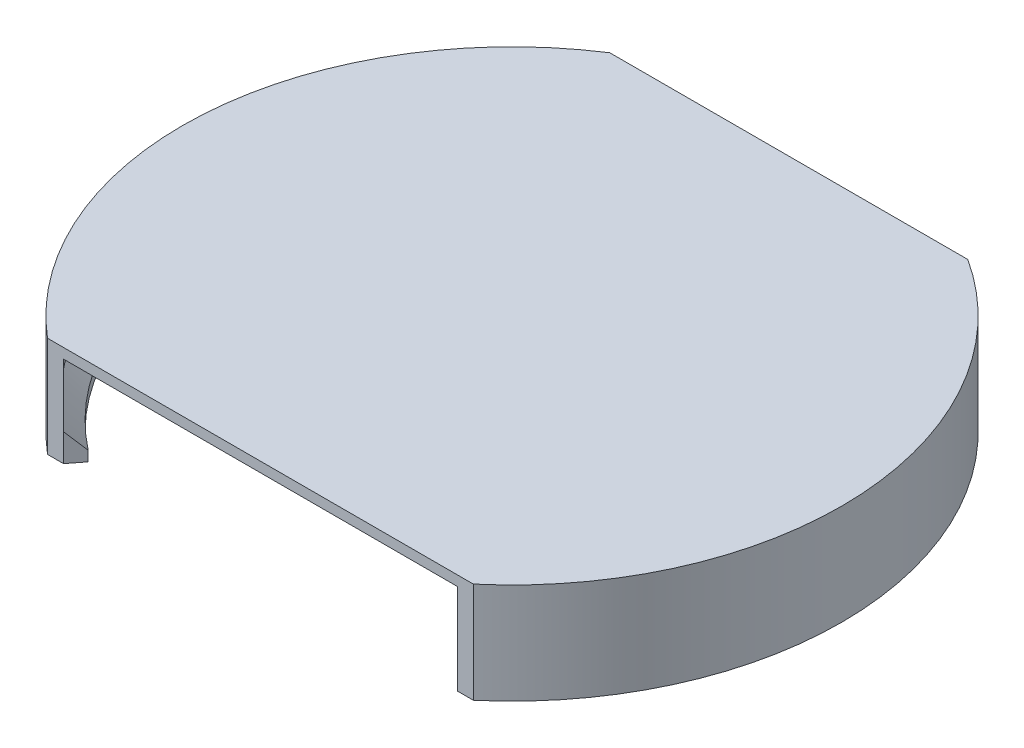
ISO-10303-21;
HEADER;
FILE_DESCRIPTION(('STEP AP214'),'2;1');
FILE_NAME('part.step','',(''),(''),'','','');
FILE_SCHEMA(('AUTOMOTIVE_DESIGN { 1 0 10303 214 1 1 1 1 }'));
ENDSEC;
DATA;
#1=APPLICATION_CONTEXT('core data for automotive mechanical design processes');
#2=APPLICATION_PROTOCOL_DEFINITION('international standard','automotive_design',2000,#1);
#3=PRODUCT_CONTEXT('',#1,'mechanical');
#4=PRODUCT('Part','Part','',(#3));
#5=PRODUCT_RELATED_PRODUCT_CATEGORY('part','',(#4));
#6=PRODUCT_DEFINITION_FORMATION('','',#4);
#7=PRODUCT_DEFINITION_CONTEXT('part definition',#1,'design');
#8=PRODUCT_DEFINITION('design','',#6,#7);
#9=PRODUCT_DEFINITION_SHAPE('','',#8);
#10=(LENGTH_UNIT() NAMED_UNIT(*) SI_UNIT(.MILLI.,.METRE.));
#11=(NAMED_UNIT(*) PLANE_ANGLE_UNIT() SI_UNIT($,.RADIAN.));
#12=(NAMED_UNIT(*) SI_UNIT($,.STERADIAN.) SOLID_ANGLE_UNIT());
#13=UNCERTAINTY_MEASURE_WITH_UNIT(LENGTH_MEASURE(1.E-05),#10,'distance_accuracy_value','');
#14=(GEOMETRIC_REPRESENTATION_CONTEXT(3) GLOBAL_UNCERTAINTY_ASSIGNED_CONTEXT((#13)) GLOBAL_UNIT_ASSIGNED_CONTEXT((#10,
#11,#12)) REPRESENTATION_CONTEXT('',''));
#15=CARTESIAN_POINT('',(0.,0.,0.));
#16=DIRECTION('',(0.,0.,1.));
#17=DIRECTION('',(1.,0.,0.));
#18=AXIS2_PLACEMENT_3D('',#15,#16,#17);
#19=CARTESIAN_POINT('',(31.7372021451167,2.,-55.));
#20=DIRECTION('',(0.,0.,1.));
#21=DIRECTION('',(1.,0.,0.));
#22=AXIS2_PLACEMENT_3D('',#19,#20,#21);
#23=PLANE('',#22);
#24=DIRECTION('',(-1.,0.,0.));
#25=VECTOR('',#24,1.);
#26=CARTESIAN_POINT('',(31.7372021451167,0.,-55.));
#27=LINE('',#26,#25);
#28=CARTESIAN_POINT('',(31.7372021451167,0.,-55.));
#29=VERTEX_POINT('',#28);
#30=CARTESIAN_POINT('',(-31.7372021451167,0.,-55.));
#31=VERTEX_POINT('',#30);
#32=EDGE_CURVE('E72',#29,#31,#27,.T.);
#33=ORIENTED_EDGE('',*,*,#32,.T.);
#34=DIRECTION('',(0.,-1.,0.));
#35=VECTOR('',#34,1.);
#36=CARTESIAN_POINT('',(-31.7372021451167,112.29472570794,-55.));
#37=LINE('',#36,#35);
#38=CARTESIAN_POINT('',(-31.7372021451167,-12.5,-55.));
#39=VERTEX_POINT('',#38);
#40=EDGE_CURVE('E176',#31,#39,#37,.T.);
#41=ORIENTED_EDGE('',*,*,#40,.T.);
#42=DIRECTION('',(0.,1.,0.));
#43=VECTOR('',#42,1.);
#44=CARTESIAN_POINT('',(-31.7372021451167,-18.,-55.));
#45=LINE('',#44,#43);
#46=CARTESIAN_POINT('',(-31.7372021451167,-18.,-55.));
#47=VERTEX_POINT('',#46);
#48=EDGE_CURVE('E154',#47,#39,#45,.T.);
#49=ORIENTED_EDGE('',*,*,#48,.F.);
#50=DIRECTION('',(1.,0.,0.));
#51=VECTOR('',#50,1.);
#52=CARTESIAN_POINT('',(0.,-18.,-55.));
#53=LINE('',#52,#51);
#54=CARTESIAN_POINT('',(-35.5703528236648,-18.,-55.));
#55=VERTEX_POINT('',#54);
#56=EDGE_CURVE('E163',#55,#47,#53,.T.);
#57=ORIENTED_EDGE('',*,*,#56,.F.);
#58=DIRECTION('',(0.,-1.,0.));
#59=VECTOR('',#58,1.);
#60=CARTESIAN_POINT('',(-35.5703528236648,112.29472570794,-55.));
#61=LINE('',#60,#59);
#62=CARTESIAN_POINT('',(-35.5703528236648,2.,-55.));
#63=VERTEX_POINT('',#62);
#64=EDGE_CURVE('E192',#63,#55,#61,.T.);
#65=ORIENTED_EDGE('',*,*,#64,.F.);
#66=DIRECTION('',(-1.,0.,0.));
#67=VECTOR('',#66,1.);
#68=CARTESIAN_POINT('',(31.7372021451167,2.,-55.));
#69=LINE('',#68,#67);
#70=CARTESIAN_POINT('',(35.5703528236648,2.,-55.));
#71=VERTEX_POINT('',#70);
#72=EDGE_CURVE('E291',#71,#63,#69,.T.);
#73=ORIENTED_EDGE('',*,*,#72,.F.);
#74=DIRECTION('',(0.,-1.,0.));
#75=VECTOR('',#74,1.);
#76=CARTESIAN_POINT('',(35.5703528236648,112.29472570794,-55.));
#77=LINE('',#76,#75);
#78=CARTESIAN_POINT('',(35.5703528236648,-18.,-55.));
#79=VERTEX_POINT('',#78);
#80=EDGE_CURVE('E251',#71,#79,#77,.T.);
#81=ORIENTED_EDGE('',*,*,#80,.T.);
#82=DIRECTION('',(1.,0.,0.));
#83=VECTOR('',#82,1.);
#84=CARTESIAN_POINT('',(-2.98688361131255E-13,-18.,-54.9999999999998));
#85=LINE('',#84,#83);
#86=CARTESIAN_POINT('',(31.7372021451167,-18.,-55.));
#87=VERTEX_POINT('',#86);
#88=EDGE_CURVE('E221',#87,#79,#85,.T.);
#89=ORIENTED_EDGE('',*,*,#88,.F.);
#90=DIRECTION('',(0.,1.,0.));
#91=VECTOR('',#90,1.);
#92=CARTESIAN_POINT('',(31.7372021451167,-18.,-55.));
#93=LINE('',#92,#91);
#94=CARTESIAN_POINT('',(31.7372021451167,-12.5,-55.));
#95=VERTEX_POINT('',#94);
#96=EDGE_CURVE('E239',#87,#95,#93,.T.);
#97=ORIENTED_EDGE('',*,*,#96,.T.);
#98=DIRECTION('',(0.,-1.,0.));
#99=VECTOR('',#98,1.);
#100=CARTESIAN_POINT('',(31.7372021451167,112.29472570794,-55.));
#101=LINE('',#100,#99);
#102=EDGE_CURVE('E260',#29,#95,#101,.T.);
#103=ORIENTED_EDGE('',*,*,#102,.F.);
#104=EDGE_LOOP('',(#33,#41,#49,#57,#65,#73,#81,#89,#97,#103));
#105=FACE_BOUND('',#104,.T.);
#106=ADVANCED_FACE('F49',(#105),#23,.F.);
#107=CARTESIAN_POINT('',(-39.1439650520996,2.,50.));
#108=DIRECTION('',(0.,0.,-1.));
#109=DIRECTION('',(-1.,0.,0.));
#110=AXIS2_PLACEMENT_3D('',#107,#108,#109);
#111=PLANE('',#110);
#112=DIRECTION('',(1.,0.,0.));
#113=VECTOR('',#112,1.);
#114=CARTESIAN_POINT('',(-39.1439650520996,0.,50.));
#115=LINE('',#114,#113);
#116=CARTESIAN_POINT('',(-39.1439650520997,0.,50.));
#117=VERTEX_POINT('',#116);
#118=CARTESIAN_POINT('',(39.1439650520996,0.,50.));
#119=VERTEX_POINT('',#118);
#120=EDGE_CURVE('E64',#117,#119,#115,.T.);
#121=ORIENTED_EDGE('',*,*,#120,.T.);
#122=DIRECTION('',(0.,-1.,0.));
#123=VECTOR('',#122,1.);
#124=CARTESIAN_POINT('',(39.1439650520996,112.29472570794,50.));
#125=LINE('',#124,#123);
#126=CARTESIAN_POINT('',(39.1439650520996,-12.5,50.));
#127=VERTEX_POINT('',#126);
#128=EDGE_CURVE('E257',#119,#127,#125,.T.);
#129=ORIENTED_EDGE('',*,*,#128,.T.);
#130=DIRECTION('',(0.,1.,0.));
#131=VECTOR('',#130,1.);
#132=CARTESIAN_POINT('',(39.1439650520996,-18.,50.));
#133=LINE('',#132,#131);
#134=CARTESIAN_POINT('',(39.1439650520996,-18.,50.));
#135=VERTEX_POINT('',#134);
#136=EDGE_CURVE('E232',#135,#127,#133,.T.);
#137=ORIENTED_EDGE('',*,*,#136,.F.);
#138=DIRECTION('',(-1.,0.,0.));
#139=VECTOR('',#138,1.);
#140=CARTESIAN_POINT('',(-1.09536775440519E-13,-18.,49.9999999999999));
#141=LINE('',#140,#139);
#142=CARTESIAN_POINT('',(42.31134599608,-18.,50.));
#143=VERTEX_POINT('',#142);
#144=EDGE_CURVE('E229',#143,#135,#141,.T.);
#145=ORIENTED_EDGE('',*,*,#144,.F.);
#146=DIRECTION('',(0.,-1.,0.));
#147=VECTOR('',#146,1.);
#148=CARTESIAN_POINT('',(42.31134599608,112.29472570794,50.));
#149=LINE('',#148,#147);
#150=CARTESIAN_POINT('',(42.31134599608,2.,50.));
#151=VERTEX_POINT('',#150);
#152=EDGE_CURVE('E256',#151,#143,#149,.T.);
#153=ORIENTED_EDGE('',*,*,#152,.F.);
#154=DIRECTION('',(1.,0.,0.));
#155=VECTOR('',#154,1.);
#156=CARTESIAN_POINT('',(-39.1439650520996,2.,50.));
#157=LINE('',#156,#155);
#158=CARTESIAN_POINT('',(-42.3113459960801,2.,50.));
#159=VERTEX_POINT('',#158);
#160=EDGE_CURVE('E57',#159,#151,#157,.T.);
#161=ORIENTED_EDGE('',*,*,#160,.F.);
#162=DIRECTION('',(0.,-1.,0.));
#163=VECTOR('',#162,1.);
#164=CARTESIAN_POINT('',(-42.3113459960801,112.29472570794,50.));
#165=LINE('',#164,#163);
#166=CARTESIAN_POINT('',(-42.3113459960801,-18.,50.));
#167=VERTEX_POINT('',#166);
#168=EDGE_CURVE('E187',#159,#167,#165,.T.);
#169=ORIENTED_EDGE('',*,*,#168,.T.);
#170=DIRECTION('',(-1.,0.,0.));
#171=VECTOR('',#170,1.);
#172=CARTESIAN_POINT('',(-1.09536775440519E-13,-18.,50.0000000000001));
#173=LINE('',#172,#171);
#174=CARTESIAN_POINT('',(-39.1439650520997,-18.,50.));
#175=VERTEX_POINT('',#174);
#176=EDGE_CURVE('E312',#175,#167,#173,.T.);
#177=ORIENTED_EDGE('',*,*,#176,.F.);
#178=DIRECTION('',(0.,1.,0.));
#179=VECTOR('',#178,1.);
#180=CARTESIAN_POINT('',(-39.1439650520997,-18.,50.));
#181=LINE('',#180,#179);
#182=CARTESIAN_POINT('',(-39.1439650520997,-12.5,50.));
#183=VERTEX_POINT('',#182);
#184=EDGE_CURVE('E311',#175,#183,#181,.T.);
#185=ORIENTED_EDGE('',*,*,#184,.T.);
#186=DIRECTION('',(0.,-1.,0.));
#187=VECTOR('',#186,1.);
#188=CARTESIAN_POINT('',(-39.1439650520997,112.29472570794,50.));
#189=LINE('',#188,#187);
#190=EDGE_CURVE('E178',#117,#183,#189,.T.);
#191=ORIENTED_EDGE('',*,*,#190,.F.);
#192=EDGE_LOOP('',(#121,#129,#137,#145,#153,#161,#169,#177,#185,#191));
#193=FACE_BOUND('',#192,.T.);
#194=ADVANCED_FACE('F309',(#193),#111,.F.);
#195=CARTESIAN_POINT('',(0.,2.,0.));
#196=DIRECTION('',(0.,1.,0.));
#197=DIRECTION('',(0.,0.,1.));
#198=AXIS2_PLACEMENT_3D('',#195,#196,#197);
#199=PLANE('',#198);
#200=ORIENTED_EDGE('',*,*,#160,.T.);
#201=CARTESIAN_POINT('',(0.,2.,0.));
#202=DIRECTION('',(0.,1.,0.));
#203=DIRECTION('',(0.,0.,1.));
#204=AXIS2_PLACEMENT_3D('',#201,#202,#203);
#205=CIRCLE('',#204,65.5);
#206=EDGE_CURVE('E252',#71,#151,#205,.F.);
#207=ORIENTED_EDGE('',*,*,#206,.F.);
#208=ORIENTED_EDGE('',*,*,#72,.T.);
#209=CARTESIAN_POINT('',(0.,2.,0.));
#210=DIRECTION('',(0.,1.,0.));
#211=DIRECTION('',(0.,0.,1.));
#212=AXIS2_PLACEMENT_3D('',#209,#210,#211);
#213=CIRCLE('',#212,65.5);
#214=EDGE_CURVE('E191',#159,#63,#213,.F.);
#215=ORIENTED_EDGE('',*,*,#214,.F.);
#216=EDGE_LOOP('',(#200,#207,#208,#215));
#217=FACE_BOUND('',#216,.T.);
#218=ADVANCED_FACE('F348',(#217),#199,.T.);
#219=CARTESIAN_POINT('',(0.,0.,0.));
#220=DIRECTION('',(0.,1.,0.));
#221=DIRECTION('',(0.,0.,1.));
#222=AXIS2_PLACEMENT_3D('',#219,#220,#221);
#223=PLANE('',#222);
#224=CARTESIAN_POINT('',(0.,0.,0.));
#225=DIRECTION('',(0.,1.,0.));
#226=DIRECTION('',(0.,0.,1.));
#227=AXIS2_PLACEMENT_3D('',#224,#225,#226);
#228=CIRCLE('',#227,45.);
#229=CARTESIAN_POINT('',(0.,0.,45.));
#230=VERTEX_POINT('',#229);
#231=EDGE_CURVE('E11',#230,#230,#228,.F.);
#232=ORIENTED_EDGE('',*,*,#231,.F.);
#233=EDGE_LOOP('',(#232));
#234=FACE_BOUND('',#233,.T.);
#235=CARTESIAN_POINT('',(0.,0.,0.));
#236=DIRECTION('',(0.,1.,0.));
#237=DIRECTION('',(0.,0.,1.));
#238=AXIS2_PLACEMENT_3D('',#235,#236,#237);
#239=CIRCLE('',#238,63.5);
#240=EDGE_CURVE('E290',#119,#29,#239,.T.);
#241=ORIENTED_EDGE('',*,*,#240,.F.);
#242=ORIENTED_EDGE('',*,*,#120,.F.);
#243=CARTESIAN_POINT('',(0.,0.,0.));
#244=DIRECTION('',(0.,1.,0.));
#245=DIRECTION('',(0.,0.,1.));
#246=AXIS2_PLACEMENT_3D('',#243,#244,#245);
#247=CIRCLE('',#246,63.5);
#248=EDGE_CURVE('E301',#31,#117,#247,.T.);
#249=ORIENTED_EDGE('',*,*,#248,.F.);
#250=ORIENTED_EDGE('',*,*,#32,.F.);
#251=EDGE_LOOP('',(#241,#242,#249,#250));
#252=FACE_BOUND('',#251,.T.);
#253=ADVANCED_FACE('F373',(#234,#252),#223,.F.);
#254=CARTESIAN_POINT('',(0.,-5.,0.));
#255=DIRECTION('',(0.,-1.,0.));
#256=DIRECTION('',(0.,0.,-1.));
#257=AXIS2_PLACEMENT_3D('',#254,#255,#256);
#258=PLANE('',#257);
#259=CARTESIAN_POINT('',(0.,-5.,0.));
#260=DIRECTION('',(0.,-1.,0.));
#261=DIRECTION('',(0.,0.,-1.));
#262=AXIS2_PLACEMENT_3D('',#259,#260,#261);
#263=CIRCLE('',#262,45.);
#264=CARTESIAN_POINT('',(0.,-5.,-45.));
#265=VERTEX_POINT('',#264);
#266=EDGE_CURVE('E283',#265,#265,#263,.T.);
#267=ORIENTED_EDGE('',*,*,#266,.T.);
#268=EDGE_LOOP('',(#267));
#269=FACE_BOUND('',#268,.T.);
#270=CARTESIAN_POINT('',(0.,-5.,0.));
#271=DIRECTION('',(0.,-1.,0.));
#272=DIRECTION('',(0.,0.,-1.));
#273=AXIS2_PLACEMENT_3D('',#270,#271,#272);
#274=CIRCLE('',#273,43.5);
#275=CARTESIAN_POINT('',(0.,-5.,-43.5));
#276=VERTEX_POINT('',#275);
#277=EDGE_CURVE('E279',#276,#276,#274,.T.);
#278=ORIENTED_EDGE('',*,*,#277,.F.);
#279=EDGE_LOOP('',(#278));
#280=FACE_BOUND('',#279,.T.);
#281=ADVANCED_FACE('F375',(#269,#280),#258,.T.);
#282=CARTESIAN_POINT('',(0.,-5.,0.));
#283=DIRECTION('',(0.,1.,0.));
#284=DIRECTION('',(0.,0.,1.));
#285=AXIS2_PLACEMENT_3D('',#282,#283,#284);
#286=CYLINDRICAL_SURFACE('',#285,45.);
#287=ORIENTED_EDGE('',*,*,#266,.F.);
#288=EDGE_LOOP('',(#287));
#289=FACE_BOUND('',#288,.T.);
#290=ORIENTED_EDGE('',*,*,#231,.T.);
#291=EDGE_LOOP('',(#290));
#292=FACE_BOUND('',#291,.T.);
#293=ADVANCED_FACE('F383',(#289,#292),#286,.T.);
#294=CARTESIAN_POINT('',(0.,-5.,0.));
#295=DIRECTION('',(0.,1.,0.));
#296=DIRECTION('',(0.,0.,1.));
#297=AXIS2_PLACEMENT_3D('',#294,#295,#296);
#298=CYLINDRICAL_SURFACE('',#297,43.5);
#299=ORIENTED_EDGE('',*,*,#277,.T.);
#300=EDGE_LOOP('',(#299));
#301=FACE_BOUND('',#300,.T.);
#302=CARTESIAN_POINT('',(0.,0.,0.));
#303=DIRECTION('',(0.,-1.,0.));
#304=DIRECTION('',(0.,0.,-1.));
#305=AXIS2_PLACEMENT_3D('',#302,#303,#304);
#306=CIRCLE('',#305,43.5);
#307=CARTESIAN_POINT('',(0.,0.,-43.5));
#308=VERTEX_POINT('',#307);
#309=EDGE_CURVE('E278',#308,#308,#306,.T.);
#310=ORIENTED_EDGE('',*,*,#309,.F.);
#311=EDGE_LOOP('',(#310));
#312=FACE_BOUND('',#311,.T.);
#313=ADVANCED_FACE('F389',(#301,#312),#298,.F.);
#314=ORIENTED_EDGE('',*,*,#309,.T.);
#315=EDGE_LOOP('',(#314));
#316=FACE_BOUND('',#315,.T.);
#317=ADVANCED_FACE('F378',(#316),#223,.F.);
#318=CARTESIAN_POINT('',(0.,112.29472570794,0.));
#319=DIRECTION('',(0.,-1.,0.));
#320=DIRECTION('',(0.,0.,-1.));
#321=AXIS2_PLACEMENT_3D('',#318,#319,#320);
#322=CYLINDRICAL_SURFACE('',#321,63.5);
#323=ORIENTED_EDGE('',*,*,#240,.T.);
#324=ORIENTED_EDGE('',*,*,#102,.T.);
#325=CARTESIAN_POINT('',(0.,-12.5,0.));
#326=DIRECTION('',(0.,-1.,0.));
#327=DIRECTION('',(0.,0.,-1.));
#328=AXIS2_PLACEMENT_3D('',#325,#326,#327);
#329=CIRCLE('',#328,63.5);
#330=EDGE_CURVE('E267',#95,#127,#329,.T.);
#331=ORIENTED_EDGE('',*,*,#330,.T.);
#332=ORIENTED_EDGE('',*,*,#128,.F.);
#333=EDGE_LOOP('',(#323,#324,#331,#332));
#334=FACE_BOUND('',#333,.T.);
#335=ADVANCED_FACE('F371',(#334),#322,.F.);
#336=CARTESIAN_POINT('',(0.,112.29472570794,0.));
#337=DIRECTION('',(0.,-1.,0.));
#338=DIRECTION('',(0.,0.,-1.));
#339=AXIS2_PLACEMENT_3D('',#336,#337,#338);
#340=CYLINDRICAL_SURFACE('',#339,65.5);
#341=ORIENTED_EDGE('',*,*,#80,.F.);
#342=ORIENTED_EDGE('',*,*,#206,.T.);
#343=ORIENTED_EDGE('',*,*,#152,.T.);
#344=CARTESIAN_POINT('',(0.,-18.,0.));
#345=DIRECTION('',(0.,-1.,0.));
#346=DIRECTION('',(0.,0.,-1.));
#347=AXIS2_PLACEMENT_3D('',#344,#345,#346);
#348=CIRCLE('',#347,65.5);
#349=EDGE_CURVE('E225',#79,#143,#348,.T.);
#350=ORIENTED_EDGE('',*,*,#349,.F.);
#351=EDGE_LOOP('',(#341,#342,#343,#350));
#352=FACE_BOUND('',#351,.T.);
#353=ADVANCED_FACE('F352',(#352),#340,.T.);
#354=CARTESIAN_POINT('',(0.,-18.,0.));
#355=DIRECTION('',(0.78740157480315,0.,-0.616440394521254));
#356=DIRECTION('',(-0.616440394521254,0.,-0.78740157480315));
#357=AXIS2_PLACEMENT_3D('',#354,#355,#356);
#358=PLANE('',#357);
#359=ORIENTED_EDGE('',*,*,#136,.T.);
#360=DIRECTION('',(-0.435889183163291,-0.707106781186545,-0.556776993060276));
#361=VECTOR('',#360,1.);
#362=CARTESIAN_POINT('',(0.,-75.9999999999996,0.));
#363=LINE('',#362,#361);
#364=CARTESIAN_POINT('',(36.9864236712753,-16.,47.244094488189));
#365=VERTEX_POINT('',#364);
#366=EDGE_CURVE('E275',#127,#365,#363,.T.);
#367=ORIENTED_EDGE('',*,*,#366,.T.);
#368=DIRECTION('',(0.,1.,0.));
#369=VECTOR('',#368,1.);
#370=CARTESIAN_POINT('',(36.9864236712753,-18.,47.244094488189));
#371=LINE('',#370,#369);
#372=CARTESIAN_POINT('',(36.9864236712753,-18.,47.244094488189));
#373=VERTEX_POINT('',#372);
#374=EDGE_CURVE('E247',#373,#365,#371,.T.);
#375=ORIENTED_EDGE('',*,*,#374,.F.);
#376=DIRECTION('',(-0.616440394521254,0.,-0.78740157480315));
#377=VECTOR('',#376,1.);
#378=CARTESIAN_POINT('',(0.,-18.,0.));
#379=LINE('',#378,#377);
#380=EDGE_CURVE('E210',#135,#373,#379,.T.);
#381=ORIENTED_EDGE('',*,*,#380,.F.);
#382=EDGE_LOOP('',(#359,#367,#375,#381));
#383=FACE_BOUND('',#382,.T.);
#384=ADVANCED_FACE('F362',(#383),#358,.F.);
#385=CARTESIAN_POINT('',(0.,-18.,0.));
#386=DIRECTION('',(0.,1.,0.));
#387=DIRECTION('',(0.,0.,1.));
#388=AXIS2_PLACEMENT_3D('',#385,#386,#387);
#389=CYLINDRICAL_SURFACE('',#388,60.);
#390=CARTESIAN_POINT('',(0.,-16.,0.));
#391=DIRECTION('',(0.,-1.,0.));
#392=DIRECTION('',(0.,0.,-1.));
#393=AXIS2_PLACEMENT_3D('',#390,#391,#392);
#394=CIRCLE('',#393,60.);
#395=CARTESIAN_POINT('',(29.987907538693,-16.,-51.9685039370078));
#396=VERTEX_POINT('',#395);
#397=EDGE_CURVE('E209',#365,#396,#394,.F.);
#398=ORIENTED_EDGE('',*,*,#397,.T.);
#399=DIRECTION('',(0.,1.,0.));
#400=VECTOR('',#399,1.);
#401=CARTESIAN_POINT('',(29.987907538693,-18.,-51.9685039370078));
#402=LINE('',#401,#400);
#403=CARTESIAN_POINT('',(29.987907538693,-18.,-51.9685039370078));
#404=VERTEX_POINT('',#403);
#405=EDGE_CURVE('E243',#404,#396,#402,.T.);
#406=ORIENTED_EDGE('',*,*,#405,.F.);
#407=CARTESIAN_POINT('',(0.,-18.,0.));
#408=DIRECTION('',(0.,-1.,0.));
#409=DIRECTION('',(0.,0.,-1.));
#410=AXIS2_PLACEMENT_3D('',#407,#408,#409);
#411=CIRCLE('',#410,60.);
#412=EDGE_CURVE('E214',#373,#404,#411,.F.);
#413=ORIENTED_EDGE('',*,*,#412,.F.);
#414=ORIENTED_EDGE('',*,*,#374,.T.);
#415=EDGE_LOOP('',(#398,#406,#413,#414));
#416=FACE_BOUND('',#415,.T.);
#417=ADVANCED_FACE('F365',(#416),#389,.F.);
#418=CARTESIAN_POINT('',(6.49087083294633E-13,-18.,3.74549235860099E-13));
#419=DIRECTION('',(-0.86614173228347,0.,-0.499798458978206));
#420=DIRECTION('',(-0.499798458978206,0.,0.86614173228347));
#421=AXIS2_PLACEMENT_3D('',#418,#419,#420);
#422=PLANE('',#421);
#423=ORIENTED_EDGE('',*,*,#405,.T.);
#424=DIRECTION('',(-0.353410879570077,-0.707106781186545,0.612454692366307));
#425=VECTOR('',#424,1.);
#426=CARTESIAN_POINT('',(6.49087083294633E-13,-75.9999999999996,3.74549235860099E-13));
#427=LINE('',#426,#425);
#428=EDGE_CURVE('E271',#396,#95,#427,.F.);
#429=ORIENTED_EDGE('',*,*,#428,.T.);
#430=ORIENTED_EDGE('',*,*,#96,.F.);
#431=DIRECTION('',(-0.499798458978206,0.,0.86614173228347));
#432=VECTOR('',#431,1.);
#433=CARTESIAN_POINT('',(6.49087083294633E-13,-18.,3.74549235860099E-13));
#434=LINE('',#433,#432);
#435=EDGE_CURVE('E217',#87,#404,#434,.T.);
#436=ORIENTED_EDGE('',*,*,#435,.T.);
#437=EDGE_LOOP('',(#423,#429,#430,#436));
#438=FACE_BOUND('',#437,.T.);
#439=ADVANCED_FACE('F368',(#438),#422,.T.);
#440=CARTESIAN_POINT('',(0.,-18.,0.));
#441=DIRECTION('',(0.,-1.,0.));
#442=DIRECTION('',(0.,0.,-1.));
#443=AXIS2_PLACEMENT_3D('',#440,#441,#442);
#444=PLANE('',#443);
#445=ORIENTED_EDGE('',*,*,#380,.T.);
#446=ORIENTED_EDGE('',*,*,#412,.T.);
#447=ORIENTED_EDGE('',*,*,#435,.F.);
#448=ORIENTED_EDGE('',*,*,#88,.T.);
#449=ORIENTED_EDGE('',*,*,#349,.T.);
#450=ORIENTED_EDGE('',*,*,#144,.T.);
#451=EDGE_LOOP('',(#445,#446,#447,#448,#449,#450));
#452=FACE_BOUND('',#451,.T.);
#453=ADVANCED_FACE('F355',(#452),#444,.T.);
#454=CARTESIAN_POINT('',(0.,-16.,0.));
#455=DIRECTION('',(0.,1.,0.));
#456=DIRECTION('',(0.,0.,1.));
#457=AXIS2_PLACEMENT_3D('',#454,#455,#456);
#458=CONICAL_SURFACE('',#457,59.9999999999999,0.785398163397451);
#459=ORIENTED_EDGE('',*,*,#366,.F.);
#460=ORIENTED_EDGE('',*,*,#330,.F.);
#461=ORIENTED_EDGE('',*,*,#428,.F.);
#462=ORIENTED_EDGE('',*,*,#397,.F.);
#463=EDGE_LOOP('',(#459,#460,#461,#462));
#464=FACE_BOUND('',#463,.T.);
#465=ADVANCED_FACE('F496',(#464),#458,.F.);
#466=CARTESIAN_POINT('',(0.,112.29472570794,0.));
#467=DIRECTION('',(0.,-1.,0.));
#468=DIRECTION('',(0.,0.,-1.));
#469=AXIS2_PLACEMENT_3D('',#466,#467,#468);
#470=CYLINDRICAL_SURFACE('',#469,63.5);
#471=ORIENTED_EDGE('',*,*,#248,.T.);
#472=ORIENTED_EDGE('',*,*,#190,.T.);
#473=CARTESIAN_POINT('',(0.,-12.5,0.));
#474=DIRECTION('',(0.,-1.,0.));
#475=DIRECTION('',(0.,0.,-1.));
#476=AXIS2_PLACEMENT_3D('',#473,#474,#475);
#477=CIRCLE('',#476,63.5);
#478=EDGE_CURVE('E190',#183,#39,#477,.T.);
#479=ORIENTED_EDGE('',*,*,#478,.T.);
#480=ORIENTED_EDGE('',*,*,#40,.F.);
#481=EDGE_LOOP('',(#471,#472,#479,#480));
#482=FACE_BOUND('',#481,.T.);
#483=ADVANCED_FACE('F306',(#482),#470,.F.);
#484=CARTESIAN_POINT('',(0.,112.29472570794,0.));
#485=DIRECTION('',(0.,-1.,0.));
#486=DIRECTION('',(0.,0.,-1.));
#487=AXIS2_PLACEMENT_3D('',#484,#485,#486);
#488=CYLINDRICAL_SURFACE('',#487,65.5);
#489=ORIENTED_EDGE('',*,*,#168,.F.);
#490=ORIENTED_EDGE('',*,*,#214,.T.);
#491=ORIENTED_EDGE('',*,*,#64,.T.);
#492=CARTESIAN_POINT('',(0.,-18.,0.));
#493=DIRECTION('',(0.,-1.,0.));
#494=DIRECTION('',(0.,0.,-1.));
#495=AXIS2_PLACEMENT_3D('',#492,#493,#494);
#496=CIRCLE('',#495,65.5);
#497=EDGE_CURVE('E170',#167,#55,#496,.T.);
#498=ORIENTED_EDGE('',*,*,#497,.F.);
#499=EDGE_LOOP('',(#489,#490,#491,#498));
#500=FACE_BOUND('',#499,.T.);
#501=ADVANCED_FACE('F342',(#500),#488,.T.);
#502=CARTESIAN_POINT('',(0.,-18.,0.));
#503=DIRECTION('',(-0.866141732283464,0.,0.499798458978216));
#504=DIRECTION('',(0.499798458978216,0.,0.866141732283464));
#505=AXIS2_PLACEMENT_3D('',#502,#503,#504);
#506=PLANE('',#505);
#507=ORIENTED_EDGE('',*,*,#48,.T.);
#508=DIRECTION('',(0.353410879570084,-0.707106781186545,0.612454692366303));
#509=VECTOR('',#508,1.);
#510=CARTESIAN_POINT('',(0.,-75.9999999999996,0.));
#511=LINE('',#510,#509);
#512=CARTESIAN_POINT('',(-29.987907538693,-16.,-51.9685039370078));
#513=VERTEX_POINT('',#512);
#514=EDGE_CURVE('E206',#39,#513,#511,.T.);
#515=ORIENTED_EDGE('',*,*,#514,.T.);
#516=DIRECTION('',(0.,1.,0.));
#517=VECTOR('',#516,1.);
#518=CARTESIAN_POINT('',(-29.987907538693,-18.,-51.9685039370078));
#519=LINE('',#518,#517);
#520=CARTESIAN_POINT('',(-29.987907538693,-18.,-51.9685039370078));
#521=VERTEX_POINT('',#520);
#522=EDGE_CURVE('E157',#521,#513,#519,.T.);
#523=ORIENTED_EDGE('',*,*,#522,.F.);
#524=DIRECTION('',(0.499798458978216,0.,0.866141732283464));
#525=VECTOR('',#524,1.);
#526=CARTESIAN_POINT('',(0.,-18.,0.));
#527=LINE('',#526,#525);
#528=EDGE_CURVE('E150',#47,#521,#527,.T.);
#529=ORIENTED_EDGE('',*,*,#528,.F.);
#530=EDGE_LOOP('',(#507,#515,#523,#529));
#531=FACE_BOUND('',#530,.T.);
#532=ADVANCED_FACE('F152',(#531),#506,.F.);
#533=CARTESIAN_POINT('',(0.,-18.,0.));
#534=DIRECTION('',(0.,1.,0.));
#535=DIRECTION('',(0.,0.,1.));
#536=AXIS2_PLACEMENT_3D('',#533,#534,#535);
#537=CYLINDRICAL_SURFACE('',#536,60.);
#538=CARTESIAN_POINT('',(0.,-16.,0.));
#539=DIRECTION('',(0.,-1.,0.));
#540=DIRECTION('',(0.,0.,-1.));
#541=AXIS2_PLACEMENT_3D('',#538,#539,#540);
#542=CIRCLE('',#541,60.);
#543=CARTESIAN_POINT('',(-36.9864236712753,-16.,47.244094488189));
#544=VERTEX_POINT('',#543);
#545=EDGE_CURVE('E173',#544,#513,#542,.T.);
#546=ORIENTED_EDGE('',*,*,#545,.F.);
#547=DIRECTION('',(0.,1.,0.));
#548=VECTOR('',#547,1.);
#549=CARTESIAN_POINT('',(-36.9864236712753,-18.,47.244094488189));
#550=LINE('',#549,#548);
#551=CARTESIAN_POINT('',(-36.9864236712753,-18.,47.244094488189));
#552=VERTEX_POINT('',#551);
#553=EDGE_CURVE('E183',#552,#544,#550,.T.);
#554=ORIENTED_EDGE('',*,*,#553,.F.);
#555=CARTESIAN_POINT('',(0.,-18.,0.));
#556=DIRECTION('',(0.,-1.,0.));
#557=DIRECTION('',(0.,0.,-1.));
#558=AXIS2_PLACEMENT_3D('',#555,#556,#557);
#559=CIRCLE('',#558,60.);
#560=EDGE_CURVE('E162',#552,#521,#559,.T.);
#561=ORIENTED_EDGE('',*,*,#560,.T.);
#562=ORIENTED_EDGE('',*,*,#522,.T.);
#563=EDGE_LOOP('',(#546,#554,#561,#562));
#564=FACE_BOUND('',#563,.T.);
#565=ADVANCED_FACE('F327',(#564),#537,.F.);
#566=CARTESIAN_POINT('',(0.,-18.,0.));
#567=DIRECTION('',(0.787401574803149,0.,0.616440394521255));
#568=DIRECTION('',(0.616440394521255,0.,-0.787401574803149));
#569=AXIS2_PLACEMENT_3D('',#566,#567,#568);
#570=PLANE('',#569);
#571=ORIENTED_EDGE('',*,*,#553,.T.);
#572=DIRECTION('',(0.435889183163292,-0.707106781186545,-0.556776993060275));
#573=VECTOR('',#572,1.);
#574=CARTESIAN_POINT('',(0.,-75.9999999999996,0.));
#575=LINE('',#574,#573);
#576=EDGE_CURVE('E202',#544,#183,#575,.F.);
#577=ORIENTED_EDGE('',*,*,#576,.T.);
#578=ORIENTED_EDGE('',*,*,#184,.F.);
#579=DIRECTION('',(0.616440394521256,0.,-0.787401574803149));
#580=VECTOR('',#579,1.);
#581=CARTESIAN_POINT('',(0.,-18.,0.));
#582=LINE('',#581,#580);
#583=EDGE_CURVE('E329',#175,#552,#582,.T.);
#584=ORIENTED_EDGE('',*,*,#583,.T.);
#585=EDGE_LOOP('',(#571,#577,#578,#584));
#586=FACE_BOUND('',#585,.T.);
#587=ADVANCED_FACE('F320',(#586),#570,.T.);
#588=CARTESIAN_POINT('',(0.,-18.,0.));
#589=DIRECTION('',(0.,-1.,0.));
#590=DIRECTION('',(0.,0.,-1.));
#591=AXIS2_PLACEMENT_3D('',#588,#589,#590);
#592=PLANE('',#591);
#593=ORIENTED_EDGE('',*,*,#56,.T.);
#594=ORIENTED_EDGE('',*,*,#528,.T.);
#595=ORIENTED_EDGE('',*,*,#560,.F.);
#596=ORIENTED_EDGE('',*,*,#583,.F.);
#597=ORIENTED_EDGE('',*,*,#176,.T.);
#598=ORIENTED_EDGE('',*,*,#497,.T.);
#599=EDGE_LOOP('',(#593,#594,#595,#596,#597,#598));
#600=FACE_BOUND('',#599,.T.);
#601=ADVANCED_FACE('F167',(#600),#592,.T.);
#602=CARTESIAN_POINT('',(0.,-16.,0.));
#603=DIRECTION('',(0.,1.,0.));
#604=DIRECTION('',(0.,0.,1.));
#605=AXIS2_PLACEMENT_3D('',#602,#603,#604);
#606=CONICAL_SURFACE('',#605,59.9999999999999,0.785398163397451);
#607=ORIENTED_EDGE('',*,*,#514,.F.);
#608=ORIENTED_EDGE('',*,*,#478,.F.);
#609=ORIENTED_EDGE('',*,*,#576,.F.);
#610=ORIENTED_EDGE('',*,*,#545,.T.);
#611=EDGE_LOOP('',(#607,#608,#609,#610));
#612=FACE_BOUND('',#611,.T.);
#613=ADVANCED_FACE('F325',(#612),#606,.F.);
#614=CLOSED_SHELL('',(#106,#194,#218,#253,#281,#293,#313,#317,#335,#353,#384,#417,#439,#453,
#465,#483,#501,#532,#565,#587,#601,#613));
#615=MANIFOLD_SOLID_BREP('B2',#614);
#616=ADVANCED_BREP_SHAPE_REPRESENTATION('',(#18,#615),#14);
#617=SHAPE_DEFINITION_REPRESENTATION(#9,#616);
ENDSEC;
END-ISO-10303-21;
